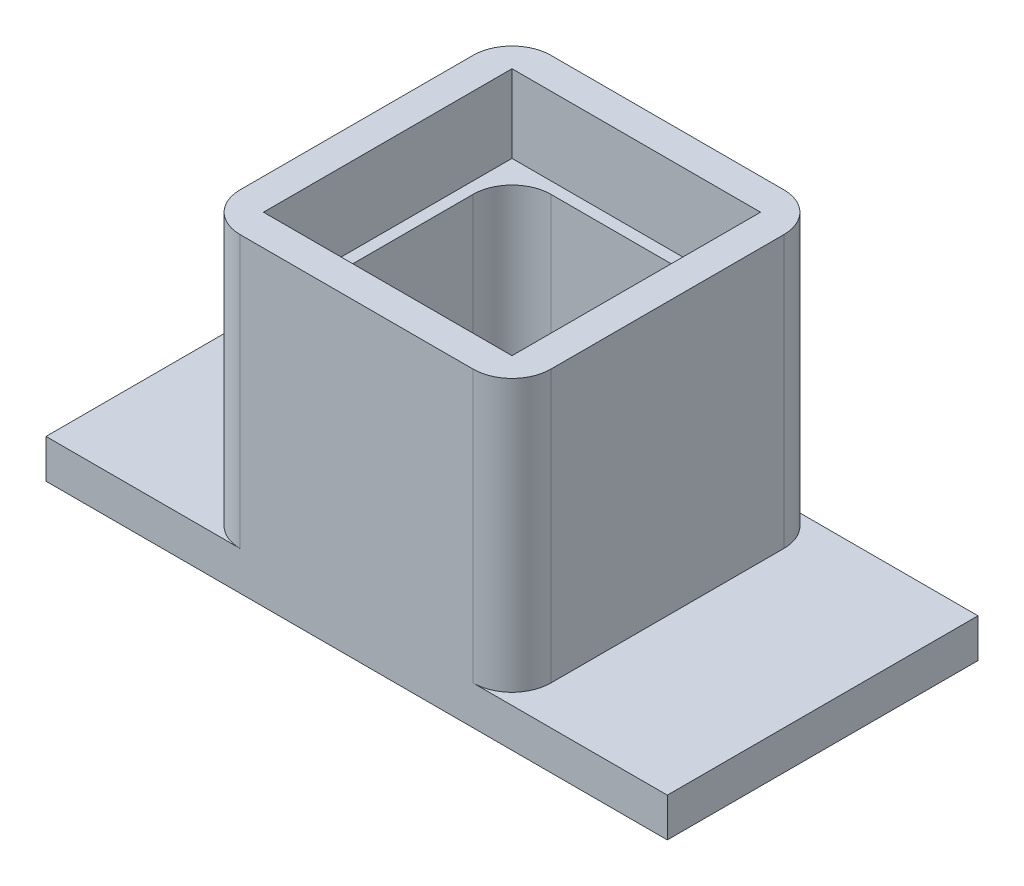
ISO-10303-21;
HEADER;
FILE_DESCRIPTION(('STEP AP214'),'2;1');
FILE_NAME('part.step','',(''),(''),'','','');
FILE_SCHEMA(('AUTOMOTIVE_DESIGN { 1 0 10303 214 1 1 1 1 }'));
ENDSEC;
DATA;
#1=APPLICATION_CONTEXT('core data for automotive mechanical design processes');
#2=APPLICATION_PROTOCOL_DEFINITION('international standard','automotive_design',2000,#1);
#3=PRODUCT_CONTEXT('',#1,'mechanical');
#4=PRODUCT('Part','Part','',(#3));
#5=PRODUCT_RELATED_PRODUCT_CATEGORY('part','',(#4));
#6=PRODUCT_DEFINITION_FORMATION('','',#4);
#7=PRODUCT_DEFINITION_CONTEXT('part definition',#1,'design');
#8=PRODUCT_DEFINITION('design','',#6,#7);
#9=PRODUCT_DEFINITION_SHAPE('','',#8);
#10=(LENGTH_UNIT() NAMED_UNIT(*) SI_UNIT(.MILLI.,.METRE.));
#11=(NAMED_UNIT(*) PLANE_ANGLE_UNIT() SI_UNIT($,.RADIAN.));
#12=(NAMED_UNIT(*) SI_UNIT($,.STERADIAN.) SOLID_ANGLE_UNIT());
#13=UNCERTAINTY_MEASURE_WITH_UNIT(LENGTH_MEASURE(1.E-05),#10,'distance_accuracy_value','');
#14=(GEOMETRIC_REPRESENTATION_CONTEXT(3) GLOBAL_UNCERTAINTY_ASSIGNED_CONTEXT((#13)) GLOBAL_UNIT_ASSIGNED_CONTEXT((#10,
#11,#12)) REPRESENTATION_CONTEXT('',''));
#15=CARTESIAN_POINT('',(0.,0.,0.));
#16=DIRECTION('',(0.,0.,1.));
#17=DIRECTION('',(1.,0.,0.));
#18=AXIS2_PLACEMENT_3D('',#15,#16,#17);
#19=CARTESIAN_POINT('',(0.,25.,0.));
#20=DIRECTION('',(0.,-1.,0.));
#21=DIRECTION('',(0.,0.,-1.));
#22=AXIS2_PLACEMENT_3D('',#19,#20,#21);
#23=PLANE('',#22);
#24=DIRECTION('',(0.,0.,-1.));
#25=VECTOR('',#24,1.);
#26=CARTESIAN_POINT('',(36.,25.,-36.));
#27=LINE('',#26,#25);
#28=CARTESIAN_POINT('',(36.,25.,-4.));
#29=VERTEX_POINT('',#28);
#30=CARTESIAN_POINT('',(36.,25.,-36.));
#31=VERTEX_POINT('',#30);
#32=EDGE_CURVE('E233',#29,#31,#27,.T.);
#33=ORIENTED_EDGE('',*,*,#32,.T.);
#34=DIRECTION('',(-1.,0.,0.));
#35=VECTOR('',#34,1.);
#36=CARTESIAN_POINT('',(4.,25.,-36.));
#37=LINE('',#36,#35);
#38=CARTESIAN_POINT('',(4.,25.,-36.));
#39=VERTEX_POINT('',#38);
#40=EDGE_CURVE('E221',#31,#39,#37,.T.);
#41=ORIENTED_EDGE('',*,*,#40,.T.);
#42=DIRECTION('',(0.,0.,1.));
#43=VECTOR('',#42,1.);
#44=CARTESIAN_POINT('',(4.,25.,-36.));
#45=LINE('',#44,#43);
#46=CARTESIAN_POINT('',(4.,25.,-4.));
#47=VERTEX_POINT('',#46);
#48=EDGE_CURVE('E224',#39,#47,#45,.T.);
#49=ORIENTED_EDGE('',*,*,#48,.T.);
#50=DIRECTION('',(1.,0.,0.));
#51=VECTOR('',#50,1.);
#52=CARTESIAN_POINT('',(4.,25.,-4.));
#53=LINE('',#52,#51);
#54=EDGE_CURVE('E243',#47,#29,#53,.T.);
#55=ORIENTED_EDGE('',*,*,#54,.T.);
#56=EDGE_LOOP('',(#33,#41,#49,#55));
#57=FACE_BOUND('',#56,.T.);
#58=DIRECTION('',(1.,0.,0.));
#59=VECTOR('',#58,1.);
#60=CARTESIAN_POINT('',(5.5,25.,-5.5));
#61=LINE('',#60,#59);
#62=CARTESIAN_POINT('',(10.5,25.,-5.5));
#63=VERTEX_POINT('',#62);
#64=CARTESIAN_POINT('',(29.5,25.,-5.5));
#65=VERTEX_POINT('',#64);
#66=EDGE_CURVE('E268',#63,#65,#61,.T.);
#67=ORIENTED_EDGE('',*,*,#66,.F.);
#68=CARTESIAN_POINT('',(10.5,25.,-10.5));
#69=DIRECTION('',(0.,-1.,0.));
#70=DIRECTION('',(0.,0.,-1.));
#71=AXIS2_PLACEMENT_3D('',#68,#69,#70);
#72=CIRCLE('',#71,5.);
#73=CARTESIAN_POINT('',(5.5,25.,-10.5));
#74=VERTEX_POINT('',#73);
#75=EDGE_CURVE('E338',#63,#74,#72,.T.);
#76=ORIENTED_EDGE('',*,*,#75,.T.);
#77=DIRECTION('',(0.,0.,1.));
#78=VECTOR('',#77,1.);
#79=CARTESIAN_POINT('',(5.5,25.,-5.5));
#80=LINE('',#79,#78);
#81=CARTESIAN_POINT('',(5.5,25.,-29.5));
#82=VERTEX_POINT('',#81);
#83=EDGE_CURVE('E277',#82,#74,#80,.T.);
#84=ORIENTED_EDGE('',*,*,#83,.F.);
#85=CARTESIAN_POINT('',(10.5,25.,-29.5));
#86=DIRECTION('',(0.,-1.,0.));
#87=DIRECTION('',(0.,0.,-1.));
#88=AXIS2_PLACEMENT_3D('',#85,#86,#87);
#89=CIRCLE('',#88,5.);
#90=CARTESIAN_POINT('',(10.5,25.,-34.5));
#91=VERTEX_POINT('',#90);
#92=EDGE_CURVE('E334',#82,#91,#89,.T.);
#93=ORIENTED_EDGE('',*,*,#92,.T.);
#94=DIRECTION('',(-1.,0.,0.));
#95=VECTOR('',#94,1.);
#96=CARTESIAN_POINT('',(5.5,25.,-34.5));
#97=LINE('',#96,#95);
#98=CARTESIAN_POINT('',(29.5,25.,-34.5));
#99=VERTEX_POINT('',#98);
#100=EDGE_CURVE('E274',#99,#91,#97,.T.);
#101=ORIENTED_EDGE('',*,*,#100,.F.);
#102=CARTESIAN_POINT('',(29.5,25.,-29.5));
#103=DIRECTION('',(0.,-1.,0.));
#104=DIRECTION('',(0.,0.,-1.));
#105=AXIS2_PLACEMENT_3D('',#102,#103,#104);
#106=CIRCLE('',#105,5.);
#107=CARTESIAN_POINT('',(34.5,25.,-29.5));
#108=VERTEX_POINT('',#107);
#109=EDGE_CURVE('E346',#99,#108,#106,.T.);
#110=ORIENTED_EDGE('',*,*,#109,.T.);
#111=DIRECTION('',(0.,0.,-1.));
#112=VECTOR('',#111,1.);
#113=CARTESIAN_POINT('',(34.5,25.,-5.5));
#114=LINE('',#113,#112);
#115=CARTESIAN_POINT('',(34.5,25.,-10.5));
#116=VERTEX_POINT('',#115);
#117=EDGE_CURVE('E271',#116,#108,#114,.T.);
#118=ORIENTED_EDGE('',*,*,#117,.F.);
#119=CARTESIAN_POINT('',(29.5,25.,-10.5));
#120=DIRECTION('',(0.,-1.,0.));
#121=DIRECTION('',(0.,0.,-1.));
#122=AXIS2_PLACEMENT_3D('',#119,#120,#121);
#123=CIRCLE('',#122,5.);
#124=EDGE_CURVE('E342',#116,#65,#123,.T.);
#125=ORIENTED_EDGE('',*,*,#124,.T.);
#126=EDGE_LOOP('',(#67,#76,#84,#93,#101,#110,#118,#125));
#127=FACE_BOUND('',#126,.T.);
#128=ADVANCED_FACE('F33',(#57,#127),#23,.F.);
#129=CARTESIAN_POINT('',(0.,25.,0.));
#130=DIRECTION('',(1.,0.,0.));
#131=DIRECTION('',(0.,0.,-1.));
#132=AXIS2_PLACEMENT_3D('',#129,#130,#131);
#133=PLANE('',#132);
#134=DIRECTION('',(0.,0.,1.));
#135=VECTOR('',#134,1.);
#136=CARTESIAN_POINT('',(0.,35.,-40.));
#137=LINE('',#136,#135);
#138=CARTESIAN_POINT('',(0.,35.,-35.));
#139=VERTEX_POINT('',#138);
#140=CARTESIAN_POINT('',(0.,35.,-5.));
#141=VERTEX_POINT('',#140);
#142=EDGE_CURVE('E256',#139,#141,#137,.T.);
#143=ORIENTED_EDGE('',*,*,#142,.F.);
#144=DIRECTION('',(0.,-1.,0.));
#145=VECTOR('',#144,1.);
#146=CARTESIAN_POINT('',(0.,25.,-35.));
#147=LINE('',#146,#145);
#148=CARTESIAN_POINT('',(0.,0.,-35.));
#149=VERTEX_POINT('',#148);
#150=EDGE_CURVE('E330',#139,#149,#147,.T.);
#151=ORIENTED_EDGE('',*,*,#150,.T.);
#152=DIRECTION('',(0.,0.,1.));
#153=VECTOR('',#152,1.);
#154=CARTESIAN_POINT('',(0.,0.,0.));
#155=LINE('',#154,#153);
#156=CARTESIAN_POINT('',(0.,0.,-5.));
#157=VERTEX_POINT('',#156);
#158=EDGE_CURVE('E280',#149,#157,#155,.T.);
#159=ORIENTED_EDGE('',*,*,#158,.T.);
#160=DIRECTION('',(0.,-1.,0.));
#161=VECTOR('',#160,1.);
#162=CARTESIAN_POINT('',(0.,25.,-5.));
#163=LINE('',#162,#161);
#164=EDGE_CURVE('E328',#157,#141,#163,.F.);
#165=ORIENTED_EDGE('',*,*,#164,.T.);
#166=EDGE_LOOP('',(#143,#151,#159,#165));
#167=FACE_BOUND('',#166,.T.);
#168=ADVANCED_FACE('F447',(#167),#133,.F.);
#169=CARTESIAN_POINT('',(0.,25.,0.));
#170=DIRECTION('',(0.,0.,-1.));
#171=DIRECTION('',(-1.,0.,0.));
#172=AXIS2_PLACEMENT_3D('',#169,#170,#171);
#173=PLANE('',#172);
#174=DIRECTION('',(-1.,0.,0.));
#175=VECTOR('',#174,1.);
#176=CARTESIAN_POINT('',(-20.,0.,0.));
#177=LINE('',#176,#175);
#178=CARTESIAN_POINT('',(60.,0.,0.));
#179=VERTEX_POINT('',#178);
#180=CARTESIAN_POINT('',(35.,0.,0.));
#181=VERTEX_POINT('',#180);
#182=EDGE_CURVE('E216',#179,#181,#177,.T.);
#183=ORIENTED_EDGE('',*,*,#182,.T.);
#184=DIRECTION('',(0.,-1.,0.));
#185=VECTOR('',#184,1.);
#186=CARTESIAN_POINT('',(35.,25.,0.));
#187=LINE('',#186,#185);
#188=CARTESIAN_POINT('',(35.,35.,0.));
#189=VERTEX_POINT('',#188);
#190=EDGE_CURVE('E313',#181,#189,#187,.F.);
#191=ORIENTED_EDGE('',*,*,#190,.T.);
#192=DIRECTION('',(1.,0.,0.));
#193=VECTOR('',#192,1.);
#194=CARTESIAN_POINT('',(0.,35.,0.));
#195=LINE('',#194,#193);
#196=CARTESIAN_POINT('',(5.,35.,0.));
#197=VERTEX_POINT('',#196);
#198=EDGE_CURVE('E259',#197,#189,#195,.T.);
#199=ORIENTED_EDGE('',*,*,#198,.F.);
#200=DIRECTION('',(0.,-1.,0.));
#201=VECTOR('',#200,1.);
#202=CARTESIAN_POINT('',(5.,25.,0.));
#203=LINE('',#202,#201);
#204=CARTESIAN_POINT('',(5.,0.,0.));
#205=VERTEX_POINT('',#204);
#206=EDGE_CURVE('E310',#197,#205,#203,.T.);
#207=ORIENTED_EDGE('',*,*,#206,.T.);
#208=CARTESIAN_POINT('',(-20.,0.,0.));
#209=VERTEX_POINT('',#208);
#210=EDGE_CURVE('E379',#205,#209,#177,.T.);
#211=ORIENTED_EDGE('',*,*,#210,.T.);
#212=DIRECTION('',(0.,1.,0.));
#213=VECTOR('',#212,1.);
#214=CARTESIAN_POINT('',(-20.,-5.,0.));
#215=LINE('',#214,#213);
#216=CARTESIAN_POINT('',(-20.,-5.,0.));
#217=VERTEX_POINT('',#216);
#218=EDGE_CURVE('E384',#217,#209,#215,.T.);
#219=ORIENTED_EDGE('',*,*,#218,.F.);
#220=DIRECTION('',(-1.,0.,0.));
#221=VECTOR('',#220,1.);
#222=CARTESIAN_POINT('',(-20.,-5.,0.));
#223=LINE('',#222,#221);
#224=CARTESIAN_POINT('',(60.,-5.,0.));
#225=VERTEX_POINT('',#224);
#226=EDGE_CURVE('E212',#225,#217,#223,.T.);
#227=ORIENTED_EDGE('',*,*,#226,.F.);
#228=DIRECTION('',(0.,1.,0.));
#229=VECTOR('',#228,1.);
#230=CARTESIAN_POINT('',(60.,-5.,0.));
#231=LINE('',#230,#229);
#232=EDGE_CURVE('E226',#225,#179,#231,.T.);
#233=ORIENTED_EDGE('',*,*,#232,.T.);
#234=EDGE_LOOP('',(#183,#191,#199,#207,#211,#219,#227,#233));
#235=FACE_BOUND('',#234,.T.);
#236=ADVANCED_FACE('F386',(#235),#173,.F.);
#237=CARTESIAN_POINT('',(40.,25.,0.));
#238=DIRECTION('',(-1.,0.,0.));
#239=DIRECTION('',(0.,0.,1.));
#240=AXIS2_PLACEMENT_3D('',#237,#238,#239);
#241=PLANE('',#240);
#242=DIRECTION('',(0.,0.,-1.));
#243=VECTOR('',#242,1.);
#244=CARTESIAN_POINT('',(40.,35.,-40.));
#245=LINE('',#244,#243);
#246=CARTESIAN_POINT('',(40.,35.,-5.));
#247=VERTEX_POINT('',#246);
#248=CARTESIAN_POINT('',(40.,35.,-35.));
#249=VERTEX_POINT('',#248);
#250=EDGE_CURVE('E262',#247,#249,#245,.T.);
#251=ORIENTED_EDGE('',*,*,#250,.F.);
#252=DIRECTION('',(0.,-1.,0.));
#253=VECTOR('',#252,1.);
#254=CARTESIAN_POINT('',(40.,25.,-5.));
#255=LINE('',#254,#253);
#256=CARTESIAN_POINT('',(40.,0.,-5.));
#257=VERTEX_POINT('',#256);
#258=EDGE_CURVE('E307',#247,#257,#255,.T.);
#259=ORIENTED_EDGE('',*,*,#258,.T.);
#260=DIRECTION('',(0.,0.,-1.));
#261=VECTOR('',#260,1.);
#262=CARTESIAN_POINT('',(40.,0.,0.));
#263=LINE('',#262,#261);
#264=CARTESIAN_POINT('',(40.,0.,-35.));
#265=VERTEX_POINT('',#264);
#266=EDGE_CURVE('E282',#257,#265,#263,.T.);
#267=ORIENTED_EDGE('',*,*,#266,.T.);
#268=DIRECTION('',(0.,-1.,0.));
#269=VECTOR('',#268,1.);
#270=CARTESIAN_POINT('',(40.,25.,-35.));
#271=LINE('',#270,#269);
#272=EDGE_CURVE('E305',#265,#249,#271,.F.);
#273=ORIENTED_EDGE('',*,*,#272,.T.);
#274=EDGE_LOOP('',(#251,#259,#267,#273));
#275=FACE_BOUND('',#274,.T.);
#276=ADVANCED_FACE('F460',(#275),#241,.F.);
#277=CARTESIAN_POINT('',(0.,25.,-40.));
#278=DIRECTION('',(0.,0.,1.));
#279=DIRECTION('',(1.,0.,0.));
#280=AXIS2_PLACEMENT_3D('',#277,#278,#279);
#281=PLANE('',#280);
#282=DIRECTION('',(-1.,0.,0.));
#283=VECTOR('',#282,1.);
#284=CARTESIAN_POINT('',(0.,35.,-40.));
#285=LINE('',#284,#283);
#286=CARTESIAN_POINT('',(35.,35.,-40.));
#287=VERTEX_POINT('',#286);
#288=CARTESIAN_POINT('',(5.,35.,-40.));
#289=VERTEX_POINT('',#288);
#290=EDGE_CURVE('E265',#287,#289,#285,.T.);
#291=ORIENTED_EDGE('',*,*,#290,.F.);
#292=DIRECTION('',(0.,-1.,0.));
#293=VECTOR('',#292,1.);
#294=CARTESIAN_POINT('',(35.,25.,-40.));
#295=LINE('',#294,#293);
#296=CARTESIAN_POINT('',(35.,0.,-40.));
#297=VERTEX_POINT('',#296);
#298=EDGE_CURVE('E325',#287,#297,#295,.T.);
#299=ORIENTED_EDGE('',*,*,#298,.T.);
#300=DIRECTION('',(1.,0.,0.));
#301=VECTOR('',#300,1.);
#302=CARTESIAN_POINT('',(-20.,0.,-40.));
#303=LINE('',#302,#301);
#304=CARTESIAN_POINT('',(60.,0.,-40.));
#305=VERTEX_POINT('',#304);
#306=EDGE_CURVE('E367',#297,#305,#303,.T.);
#307=ORIENTED_EDGE('',*,*,#306,.T.);
#308=DIRECTION('',(0.,1.,0.));
#309=VECTOR('',#308,1.);
#310=CARTESIAN_POINT('',(60.,-5.,-40.));
#311=LINE('',#310,#309);
#312=CARTESIAN_POINT('',(60.,-5.,-40.));
#313=VERTEX_POINT('',#312);
#314=EDGE_CURVE('E202',#313,#305,#311,.T.);
#315=ORIENTED_EDGE('',*,*,#314,.F.);
#316=DIRECTION('',(1.,0.,0.));
#317=VECTOR('',#316,1.);
#318=CARTESIAN_POINT('',(-20.,-5.,-40.));
#319=LINE('',#318,#317);
#320=CARTESIAN_POINT('',(-20.,-5.,-40.));
#321=VERTEX_POINT('',#320);
#322=EDGE_CURVE('E194',#321,#313,#319,.T.);
#323=ORIENTED_EDGE('',*,*,#322,.F.);
#324=DIRECTION('',(0.,1.,0.));
#325=VECTOR('',#324,1.);
#326=CARTESIAN_POINT('',(-20.,-5.,-40.));
#327=LINE('',#326,#325);
#328=CARTESIAN_POINT('',(-20.,0.,-40.));
#329=VERTEX_POINT('',#328);
#330=EDGE_CURVE('E199',#321,#329,#327,.T.);
#331=ORIENTED_EDGE('',*,*,#330,.T.);
#332=CARTESIAN_POINT('',(5.,0.,-40.));
#333=VERTEX_POINT('',#332);
#334=EDGE_CURVE('E353',#329,#333,#303,.T.);
#335=ORIENTED_EDGE('',*,*,#334,.T.);
#336=DIRECTION('',(0.,-1.,0.));
#337=VECTOR('',#336,1.);
#338=CARTESIAN_POINT('',(5.,25.,-40.));
#339=LINE('',#338,#337);
#340=EDGE_CURVE('E323',#333,#289,#339,.F.);
#341=ORIENTED_EDGE('',*,*,#340,.T.);
#342=EDGE_LOOP('',(#291,#299,#307,#315,#323,#331,#335,#341));
#343=FACE_BOUND('',#342,.T.);
#344=ADVANCED_FACE('F197',(#343),#281,.F.);
#345=CARTESIAN_POINT('',(5.5,25.,-5.5));
#346=DIRECTION('',(0.,0.,-1.));
#347=DIRECTION('',(-1.,0.,0.));
#348=AXIS2_PLACEMENT_3D('',#345,#346,#347);
#349=PLANE('',#348);
#350=DIRECTION('',(-1.,0.,0.));
#351=VECTOR('',#350,1.);
#352=CARTESIAN_POINT('',(5.5,-5.,-5.5));
#353=LINE('',#352,#351);
#354=CARTESIAN_POINT('',(29.5,-5.,-5.5));
#355=VERTEX_POINT('',#354);
#356=CARTESIAN_POINT('',(10.5,-5.,-5.5));
#357=VERTEX_POINT('',#356);
#358=EDGE_CURVE('E389',#355,#357,#353,.T.);
#359=ORIENTED_EDGE('',*,*,#358,.T.);
#360=DIRECTION('',(0.,-1.,0.));
#361=VECTOR('',#360,1.);
#362=CARTESIAN_POINT('',(10.5,25.,-5.5));
#363=LINE('',#362,#361);
#364=EDGE_CURVE('E298',#357,#63,#363,.F.);
#365=ORIENTED_EDGE('',*,*,#364,.T.);
#366=ORIENTED_EDGE('',*,*,#66,.T.);
#367=DIRECTION('',(0.,-1.,0.));
#368=VECTOR('',#367,1.);
#369=CARTESIAN_POINT('',(29.5,-5.,-5.5));
#370=LINE('',#369,#368);
#371=EDGE_CURVE('E295',#65,#355,#370,.T.);
#372=ORIENTED_EDGE('',*,*,#371,.T.);
#373=EDGE_LOOP('',(#359,#365,#366,#372));
#374=FACE_BOUND('',#373,.T.);
#375=ADVANCED_FACE('F435',(#374),#349,.T.);
#376=CARTESIAN_POINT('',(34.5,25.,-5.5));
#377=DIRECTION('',(-1.,0.,0.));
#378=DIRECTION('',(0.,0.,1.));
#379=AXIS2_PLACEMENT_3D('',#376,#377,#378);
#380=PLANE('',#379);
#381=DIRECTION('',(0.,0.,1.));
#382=VECTOR('',#381,1.);
#383=CARTESIAN_POINT('',(34.5,-5.,-5.5));
#384=LINE('',#383,#382);
#385=CARTESIAN_POINT('',(34.5,-5.,-29.5));
#386=VERTEX_POINT('',#385);
#387=CARTESIAN_POINT('',(34.5,-5.,-10.5));
#388=VERTEX_POINT('',#387);
#389=EDGE_CURVE('E391',#386,#388,#384,.T.);
#390=ORIENTED_EDGE('',*,*,#389,.T.);
#391=DIRECTION('',(0.,-1.,0.));
#392=VECTOR('',#391,1.);
#393=CARTESIAN_POINT('',(34.5,25.,-10.5));
#394=LINE('',#393,#392);
#395=EDGE_CURVE('E303',#388,#116,#394,.F.);
#396=ORIENTED_EDGE('',*,*,#395,.T.);
#397=ORIENTED_EDGE('',*,*,#117,.T.);
#398=DIRECTION('',(0.,-1.,0.));
#399=VECTOR('',#398,1.);
#400=CARTESIAN_POINT('',(34.5,-5.,-29.5));
#401=LINE('',#400,#399);
#402=EDGE_CURVE('E300',#108,#386,#401,.T.);
#403=ORIENTED_EDGE('',*,*,#402,.T.);
#404=EDGE_LOOP('',(#390,#396,#397,#403));
#405=FACE_BOUND('',#404,.T.);
#406=ADVANCED_FACE('F428',(#405),#380,.T.);
#407=CARTESIAN_POINT('',(5.5,25.,-34.5));
#408=DIRECTION('',(0.,0.,1.));
#409=DIRECTION('',(1.,0.,0.));
#410=AXIS2_PLACEMENT_3D('',#407,#408,#409);
#411=PLANE('',#410);
#412=ORIENTED_EDGE('',*,*,#100,.T.);
#413=DIRECTION('',(0.,-1.,0.));
#414=VECTOR('',#413,1.);
#415=CARTESIAN_POINT('',(10.5,-5.,-34.5));
#416=LINE('',#415,#414);
#417=CARTESIAN_POINT('',(10.5,-5.,-34.5));
#418=VERTEX_POINT('',#417);
#419=EDGE_CURVE('E287',#91,#418,#416,.T.);
#420=ORIENTED_EDGE('',*,*,#419,.T.);
#421=DIRECTION('',(1.,0.,0.));
#422=VECTOR('',#421,1.);
#423=CARTESIAN_POINT('',(5.5,-5.,-34.5));
#424=LINE('',#423,#422);
#425=CARTESIAN_POINT('',(29.5,-5.,-34.5));
#426=VERTEX_POINT('',#425);
#427=EDGE_CURVE('E397',#418,#426,#424,.T.);
#428=ORIENTED_EDGE('',*,*,#427,.T.);
#429=DIRECTION('',(0.,-1.,0.));
#430=VECTOR('',#429,1.);
#431=CARTESIAN_POINT('',(29.5,25.,-34.5));
#432=LINE('',#431,#430);
#433=EDGE_CURVE('E285',#426,#99,#432,.F.);
#434=ORIENTED_EDGE('',*,*,#433,.T.);
#435=EDGE_LOOP('',(#412,#420,#428,#434));
#436=FACE_BOUND('',#435,.T.);
#437=ADVANCED_FACE('F419',(#436),#411,.T.);
#438=CARTESIAN_POINT('',(5.5,25.,-5.5));
#439=DIRECTION('',(1.,0.,0.));
#440=DIRECTION('',(0.,0.,-1.));
#441=AXIS2_PLACEMENT_3D('',#438,#439,#440);
#442=PLANE('',#441);
#443=DIRECTION('',(0.,0.,-1.));
#444=VECTOR('',#443,1.);
#445=CARTESIAN_POINT('',(5.5,-5.,-5.5));
#446=LINE('',#445,#444);
#447=CARTESIAN_POINT('',(5.5,-5.,-10.5));
#448=VERTEX_POINT('',#447);
#449=CARTESIAN_POINT('',(5.5,-5.,-29.5));
#450=VERTEX_POINT('',#449);
#451=EDGE_CURVE('E402',#448,#450,#446,.T.);
#452=ORIENTED_EDGE('',*,*,#451,.T.);
#453=DIRECTION('',(0.,-1.,0.));
#454=VECTOR('',#453,1.);
#455=CARTESIAN_POINT('',(5.5,25.,-29.5));
#456=LINE('',#455,#454);
#457=EDGE_CURVE('E293',#450,#82,#456,.F.);
#458=ORIENTED_EDGE('',*,*,#457,.T.);
#459=ORIENTED_EDGE('',*,*,#83,.T.);
#460=DIRECTION('',(0.,-1.,0.));
#461=VECTOR('',#460,1.);
#462=CARTESIAN_POINT('',(5.5,-5.,-10.5));
#463=LINE('',#462,#461);
#464=EDGE_CURVE('E290',#74,#448,#463,.T.);
#465=ORIENTED_EDGE('',*,*,#464,.T.);
#466=EDGE_LOOP('',(#452,#458,#459,#465));
#467=FACE_BOUND('',#466,.T.);
#468=ADVANCED_FACE('F407',(#467),#442,.T.);
#469=CARTESIAN_POINT('',(0.,35.,0.));
#470=DIRECTION('',(0.,1.,0.));
#471=DIRECTION('',(0.,0.,1.));
#472=AXIS2_PLACEMENT_3D('',#469,#470,#471);
#473=PLANE('',#472);
#474=ORIENTED_EDGE('',*,*,#198,.T.);
#475=CARTESIAN_POINT('',(35.,35.,-5.));
#476=DIRECTION('',(0.,1.,0.));
#477=DIRECTION('',(0.,0.,1.));
#478=AXIS2_PLACEMENT_3D('',#475,#476,#477);
#479=CIRCLE('',#478,5.);
#480=EDGE_CURVE('E321',#189,#247,#479,.T.);
#481=ORIENTED_EDGE('',*,*,#480,.T.);
#482=ORIENTED_EDGE('',*,*,#250,.T.);
#483=CARTESIAN_POINT('',(35.,35.,-35.));
#484=DIRECTION('',(0.,1.,0.));
#485=DIRECTION('',(0.,0.,1.));
#486=AXIS2_PLACEMENT_3D('',#483,#484,#485);
#487=CIRCLE('',#486,5.);
#488=EDGE_CURVE('E319',#249,#287,#487,.T.);
#489=ORIENTED_EDGE('',*,*,#488,.T.);
#490=ORIENTED_EDGE('',*,*,#290,.T.);
#491=CARTESIAN_POINT('',(5.,35.,-35.));
#492=DIRECTION('',(0.,1.,0.));
#493=DIRECTION('',(0.,0.,1.));
#494=AXIS2_PLACEMENT_3D('',#491,#492,#493);
#495=CIRCLE('',#494,5.);
#496=EDGE_CURVE('E317',#289,#139,#495,.T.);
#497=ORIENTED_EDGE('',*,*,#496,.T.);
#498=ORIENTED_EDGE('',*,*,#142,.T.);
#499=CARTESIAN_POINT('',(5.,35.,-5.));
#500=DIRECTION('',(0.,1.,0.));
#501=DIRECTION('',(0.,0.,1.));
#502=AXIS2_PLACEMENT_3D('',#499,#500,#501);
#503=CIRCLE('',#502,5.);
#504=EDGE_CURVE('E315',#141,#197,#503,.T.);
#505=ORIENTED_EDGE('',*,*,#504,.T.);
#506=EDGE_LOOP('',(#474,#481,#482,#489,#490,#497,#498,#505));
#507=FACE_BOUND('',#506,.T.);
#508=DIRECTION('',(0.,0.,1.));
#509=VECTOR('',#508,1.);
#510=CARTESIAN_POINT('',(4.,35.,-36.));
#511=LINE('',#510,#509);
#512=CARTESIAN_POINT('',(4.,35.,-36.));
#513=VERTEX_POINT('',#512);
#514=CARTESIAN_POINT('',(4.,35.,-4.));
#515=VERTEX_POINT('',#514);
#516=EDGE_CURVE('E232',#513,#515,#511,.T.);
#517=ORIENTED_EDGE('',*,*,#516,.F.);
#518=DIRECTION('',(-1.,0.,0.));
#519=VECTOR('',#518,1.);
#520=CARTESIAN_POINT('',(4.,35.,-36.));
#521=LINE('',#520,#519);
#522=CARTESIAN_POINT('',(36.,35.,-36.));
#523=VERTEX_POINT('',#522);
#524=EDGE_CURVE('E230',#523,#513,#521,.T.);
#525=ORIENTED_EDGE('',*,*,#524,.F.);
#526=DIRECTION('',(0.,0.,-1.));
#527=VECTOR('',#526,1.);
#528=CARTESIAN_POINT('',(36.,35.,-36.));
#529=LINE('',#528,#527);
#530=CARTESIAN_POINT('',(36.,35.,-4.));
#531=VERTEX_POINT('',#530);
#532=EDGE_CURVE('E238',#531,#523,#529,.T.);
#533=ORIENTED_EDGE('',*,*,#532,.F.);
#534=DIRECTION('',(1.,0.,0.));
#535=VECTOR('',#534,1.);
#536=CARTESIAN_POINT('',(4.,35.,-4.));
#537=LINE('',#536,#535);
#538=EDGE_CURVE('E235',#515,#531,#537,.T.);
#539=ORIENTED_EDGE('',*,*,#538,.F.);
#540=EDGE_LOOP('',(#517,#525,#533,#539));
#541=FACE_BOUND('',#540,.T.);
#542=ADVANCED_FACE('F358',(#507,#541),#473,.T.);
#543=CARTESIAN_POINT('',(4.,35.,-36.));
#544=DIRECTION('',(0.,0.,1.));
#545=DIRECTION('',(1.,0.,0.));
#546=AXIS2_PLACEMENT_3D('',#543,#544,#545);
#547=PLANE('',#546);
#548=ORIENTED_EDGE('',*,*,#40,.F.);
#549=DIRECTION('',(0.,-1.,0.));
#550=VECTOR('',#549,1.);
#551=CARTESIAN_POINT('',(36.,35.,-36.));
#552=LINE('',#551,#550);
#553=EDGE_CURVE('E239',#523,#31,#552,.T.);
#554=ORIENTED_EDGE('',*,*,#553,.F.);
#555=ORIENTED_EDGE('',*,*,#524,.T.);
#556=DIRECTION('',(0.,-1.,0.));
#557=VECTOR('',#556,1.);
#558=CARTESIAN_POINT('',(4.,35.,-36.));
#559=LINE('',#558,#557);
#560=EDGE_CURVE('E253',#513,#39,#559,.T.);
#561=ORIENTED_EDGE('',*,*,#560,.T.);
#562=EDGE_LOOP('',(#548,#554,#555,#561));
#563=FACE_BOUND('',#562,.T.);
#564=ADVANCED_FACE('F564',(#563),#547,.T.);
#565=CARTESIAN_POINT('',(4.,35.,-36.));
#566=DIRECTION('',(1.,0.,0.));
#567=DIRECTION('',(0.,0.,-1.));
#568=AXIS2_PLACEMENT_3D('',#565,#566,#567);
#569=PLANE('',#568);
#570=ORIENTED_EDGE('',*,*,#48,.F.);
#571=ORIENTED_EDGE('',*,*,#560,.F.);
#572=ORIENTED_EDGE('',*,*,#516,.T.);
#573=DIRECTION('',(0.,-1.,0.));
#574=VECTOR('',#573,1.);
#575=CARTESIAN_POINT('',(4.,35.,-4.));
#576=LINE('',#575,#574);
#577=EDGE_CURVE('E251',#515,#47,#576,.T.);
#578=ORIENTED_EDGE('',*,*,#577,.T.);
#579=EDGE_LOOP('',(#570,#571,#572,#578));
#580=FACE_BOUND('',#579,.T.);
#581=ADVANCED_FACE('F661',(#580),#569,.T.);
#582=CARTESIAN_POINT('',(4.,35.,-4.));
#583=DIRECTION('',(0.,0.,-1.));
#584=DIRECTION('',(-1.,0.,0.));
#585=AXIS2_PLACEMENT_3D('',#582,#583,#584);
#586=PLANE('',#585);
#587=ORIENTED_EDGE('',*,*,#54,.F.);
#588=ORIENTED_EDGE('',*,*,#577,.F.);
#589=ORIENTED_EDGE('',*,*,#538,.T.);
#590=DIRECTION('',(0.,-1.,0.));
#591=VECTOR('',#590,1.);
#592=CARTESIAN_POINT('',(36.,35.,-4.));
#593=LINE('',#592,#591);
#594=EDGE_CURVE('E249',#531,#29,#593,.T.);
#595=ORIENTED_EDGE('',*,*,#594,.T.);
#596=EDGE_LOOP('',(#587,#588,#589,#595));
#597=FACE_BOUND('',#596,.T.);
#598=ADVANCED_FACE('F651',(#597),#586,.T.);
#599=CARTESIAN_POINT('',(36.,35.,-36.));
#600=DIRECTION('',(-1.,0.,0.));
#601=DIRECTION('',(0.,0.,1.));
#602=AXIS2_PLACEMENT_3D('',#599,#600,#601);
#603=PLANE('',#602);
#604=ORIENTED_EDGE('',*,*,#32,.F.);
#605=ORIENTED_EDGE('',*,*,#594,.F.);
#606=ORIENTED_EDGE('',*,*,#532,.T.);
#607=ORIENTED_EDGE('',*,*,#553,.T.);
#608=EDGE_LOOP('',(#604,#605,#606,#607));
#609=FACE_BOUND('',#608,.T.);
#610=ADVANCED_FACE('F445',(#609),#603,.T.);
#611=CARTESIAN_POINT('',(0.,0.,0.));
#612=DIRECTION('',(0.,-1.,0.));
#613=DIRECTION('',(0.,0.,-1.));
#614=AXIS2_PLACEMENT_3D('',#611,#612,#613);
#615=PLANE('',#614);
#616=ORIENTED_EDGE('',*,*,#158,.F.);
#617=CARTESIAN_POINT('',(5.,0.,-35.));
#618=DIRECTION('',(0.,-1.,0.));
#619=DIRECTION('',(0.,0.,-1.));
#620=AXIS2_PLACEMENT_3D('',#617,#618,#619);
#621=CIRCLE('',#620,5.);
#622=EDGE_CURVE('E41',#149,#333,#621,.T.);
#623=ORIENTED_EDGE('',*,*,#622,.T.);
#624=ORIENTED_EDGE('',*,*,#334,.F.);
#625=DIRECTION('',(0.,0.,-1.));
#626=VECTOR('',#625,1.);
#627=CARTESIAN_POINT('',(-20.,0.,0.));
#628=LINE('',#627,#626);
#629=EDGE_CURVE('E220',#209,#329,#628,.T.);
#630=ORIENTED_EDGE('',*,*,#629,.F.);
#631=ORIENTED_EDGE('',*,*,#210,.F.);
#632=CARTESIAN_POINT('',(5.,0.,-5.));
#633=DIRECTION('',(0.,-1.,0.));
#634=DIRECTION('',(0.,0.,-1.));
#635=AXIS2_PLACEMENT_3D('',#632,#633,#634);
#636=CIRCLE('',#635,5.);
#637=EDGE_CURVE('E11',#205,#157,#636,.T.);
#638=ORIENTED_EDGE('',*,*,#637,.T.);
#639=EDGE_LOOP('',(#616,#623,#624,#630,#631,#638));
#640=FACE_BOUND('',#639,.T.);
#641=ADVANCED_FACE('F352',(#640),#615,.F.);
#642=CARTESIAN_POINT('',(0.,-5.,0.));
#643=DIRECTION('',(0.,-1.,0.));
#644=DIRECTION('',(0.,0.,-1.));
#645=AXIS2_PLACEMENT_3D('',#642,#643,#644);
#646=PLANE('',#645);
#647=DIRECTION('',(0.,0.,-1.));
#648=VECTOR('',#647,1.);
#649=CARTESIAN_POINT('',(-20.,-5.,0.));
#650=LINE('',#649,#648);
#651=EDGE_CURVE('E206',#217,#321,#650,.T.);
#652=ORIENTED_EDGE('',*,*,#651,.T.);
#653=ORIENTED_EDGE('',*,*,#322,.T.);
#654=DIRECTION('',(0.,0.,1.));
#655=VECTOR('',#654,1.);
#656=CARTESIAN_POINT('',(60.,-5.,0.));
#657=LINE('',#656,#655);
#658=EDGE_CURVE('E205',#313,#225,#657,.T.);
#659=ORIENTED_EDGE('',*,*,#658,.T.);
#660=ORIENTED_EDGE('',*,*,#226,.T.);
#661=EDGE_LOOP('',(#652,#653,#659,#660));
#662=FACE_BOUND('',#661,.T.);
#663=ORIENTED_EDGE('',*,*,#427,.F.);
#664=CARTESIAN_POINT('',(10.5,-5.,-29.5));
#665=DIRECTION('',(0.,-1.,0.));
#666=DIRECTION('',(0.,0.,-1.));
#667=AXIS2_PLACEMENT_3D('',#664,#665,#666);
#668=CIRCLE('',#667,5.);
#669=EDGE_CURVE('E332',#418,#450,#668,.F.);
#670=ORIENTED_EDGE('',*,*,#669,.T.);
#671=ORIENTED_EDGE('',*,*,#451,.F.);
#672=CARTESIAN_POINT('',(10.5,-5.,-10.5));
#673=DIRECTION('',(0.,-1.,0.));
#674=DIRECTION('',(0.,0.,-1.));
#675=AXIS2_PLACEMENT_3D('',#672,#673,#674);
#676=CIRCLE('',#675,5.);
#677=EDGE_CURVE('E336',#448,#357,#676,.F.);
#678=ORIENTED_EDGE('',*,*,#677,.T.);
#679=ORIENTED_EDGE('',*,*,#358,.F.);
#680=CARTESIAN_POINT('',(29.5,-5.,-10.5));
#681=DIRECTION('',(0.,-1.,0.));
#682=DIRECTION('',(0.,0.,-1.));
#683=AXIS2_PLACEMENT_3D('',#680,#681,#682);
#684=CIRCLE('',#683,5.);
#685=EDGE_CURVE('E340',#355,#388,#684,.F.);
#686=ORIENTED_EDGE('',*,*,#685,.T.);
#687=ORIENTED_EDGE('',*,*,#389,.F.);
#688=CARTESIAN_POINT('',(29.5,-5.,-29.5));
#689=DIRECTION('',(0.,-1.,0.));
#690=DIRECTION('',(0.,0.,-1.));
#691=AXIS2_PLACEMENT_3D('',#688,#689,#690);
#692=CIRCLE('',#691,5.);
#693=EDGE_CURVE('E344',#386,#426,#692,.F.);
#694=ORIENTED_EDGE('',*,*,#693,.T.);
#695=EDGE_LOOP('',(#663,#670,#671,#678,#679,#686,#687,#694));
#696=FACE_BOUND('',#695,.T.);
#697=ADVANCED_FACE('F209',(#662,#696),#646,.T.);
#698=ORIENTED_EDGE('',*,*,#266,.F.);
#699=CARTESIAN_POINT('',(35.,0.,-5.));
#700=DIRECTION('',(0.,-1.,0.));
#701=DIRECTION('',(0.,0.,-1.));
#702=AXIS2_PLACEMENT_3D('',#699,#700,#701);
#703=CIRCLE('',#702,5.);
#704=EDGE_CURVE('E348',#257,#181,#703,.T.);
#705=ORIENTED_EDGE('',*,*,#704,.T.);
#706=ORIENTED_EDGE('',*,*,#182,.F.);
#707=DIRECTION('',(0.,0.,1.));
#708=VECTOR('',#707,1.);
#709=CARTESIAN_POINT('',(60.,0.,0.));
#710=LINE('',#709,#708);
#711=EDGE_CURVE('E374',#305,#179,#710,.T.);
#712=ORIENTED_EDGE('',*,*,#711,.F.);
#713=ORIENTED_EDGE('',*,*,#306,.F.);
#714=CARTESIAN_POINT('',(35.,0.,-35.));
#715=DIRECTION('',(0.,-1.,0.));
#716=DIRECTION('',(0.,0.,-1.));
#717=AXIS2_PLACEMENT_3D('',#714,#715,#716);
#718=CIRCLE('',#717,5.);
#719=EDGE_CURVE('E351',#297,#265,#718,.T.);
#720=ORIENTED_EDGE('',*,*,#719,.T.);
#721=EDGE_LOOP('',(#698,#705,#706,#712,#713,#720));
#722=FACE_BOUND('',#721,.T.);
#723=ADVANCED_FACE('F378',(#722),#615,.F.);
#724=CARTESIAN_POINT('',(-20.,-5.,0.));
#725=DIRECTION('',(1.,0.,0.));
#726=DIRECTION('',(0.,0.,-1.));
#727=AXIS2_PLACEMENT_3D('',#724,#725,#726);
#728=PLANE('',#727);
#729=ORIENTED_EDGE('',*,*,#629,.T.);
#730=ORIENTED_EDGE('',*,*,#330,.F.);
#731=ORIENTED_EDGE('',*,*,#651,.F.);
#732=ORIENTED_EDGE('',*,*,#218,.T.);
#733=EDGE_LOOP('',(#729,#730,#731,#732));
#734=FACE_BOUND('',#733,.T.);
#735=ADVANCED_FACE('F218',(#734),#728,.F.);
#736=CARTESIAN_POINT('',(60.,-5.,0.));
#737=DIRECTION('',(-1.,0.,0.));
#738=DIRECTION('',(0.,0.,1.));
#739=AXIS2_PLACEMENT_3D('',#736,#737,#738);
#740=PLANE('',#739);
#741=ORIENTED_EDGE('',*,*,#711,.T.);
#742=ORIENTED_EDGE('',*,*,#232,.F.);
#743=ORIENTED_EDGE('',*,*,#658,.F.);
#744=ORIENTED_EDGE('',*,*,#314,.T.);
#745=EDGE_LOOP('',(#741,#742,#743,#744));
#746=FACE_BOUND('',#745,.T.);
#747=ADVANCED_FACE('F372',(#746),#740,.F.);
#748=CARTESIAN_POINT('',(10.5,25.,-29.5));
#749=DIRECTION('',(0.,1.,0.));
#750=DIRECTION('',(0.,0.,1.));
#751=AXIS2_PLACEMENT_3D('',#748,#749,#750);
#752=CYLINDRICAL_SURFACE('',#751,5.);
#753=ORIENTED_EDGE('',*,*,#92,.F.);
#754=ORIENTED_EDGE('',*,*,#457,.F.);
#755=ORIENTED_EDGE('',*,*,#669,.F.);
#756=ORIENTED_EDGE('',*,*,#419,.F.);
#757=EDGE_LOOP('',(#753,#754,#755,#756));
#758=FACE_BOUND('',#757,.T.);
#759=ADVANCED_FACE('F412',(#758),#752,.F.);
#760=CARTESIAN_POINT('',(10.5,25.,-10.5));
#761=DIRECTION('',(0.,1.,0.));
#762=DIRECTION('',(0.,0.,1.));
#763=AXIS2_PLACEMENT_3D('',#760,#761,#762);
#764=CYLINDRICAL_SURFACE('',#763,5.);
#765=ORIENTED_EDGE('',*,*,#75,.F.);
#766=ORIENTED_EDGE('',*,*,#364,.F.);
#767=ORIENTED_EDGE('',*,*,#677,.F.);
#768=ORIENTED_EDGE('',*,*,#464,.F.);
#769=EDGE_LOOP('',(#765,#766,#767,#768));
#770=FACE_BOUND('',#769,.T.);
#771=ADVANCED_FACE('F437',(#770),#764,.F.);
#772=CARTESIAN_POINT('',(29.5,25.,-10.5));
#773=DIRECTION('',(0.,1.,0.));
#774=DIRECTION('',(0.,0.,1.));
#775=AXIS2_PLACEMENT_3D('',#772,#773,#774);
#776=CYLINDRICAL_SURFACE('',#775,5.);
#777=ORIENTED_EDGE('',*,*,#124,.F.);
#778=ORIENTED_EDGE('',*,*,#395,.F.);
#779=ORIENTED_EDGE('',*,*,#685,.F.);
#780=ORIENTED_EDGE('',*,*,#371,.F.);
#781=EDGE_LOOP('',(#777,#778,#779,#780));
#782=FACE_BOUND('',#781,.T.);
#783=ADVANCED_FACE('F432',(#782),#776,.F.);
#784=CARTESIAN_POINT('',(29.5,25.,-29.5));
#785=DIRECTION('',(0.,1.,0.));
#786=DIRECTION('',(0.,0.,1.));
#787=AXIS2_PLACEMENT_3D('',#784,#785,#786);
#788=CYLINDRICAL_SURFACE('',#787,5.);
#789=ORIENTED_EDGE('',*,*,#109,.F.);
#790=ORIENTED_EDGE('',*,*,#433,.F.);
#791=ORIENTED_EDGE('',*,*,#693,.F.);
#792=ORIENTED_EDGE('',*,*,#402,.F.);
#793=EDGE_LOOP('',(#789,#790,#791,#792));
#794=FACE_BOUND('',#793,.T.);
#795=ADVANCED_FACE('F423',(#794),#788,.F.);
#796=CARTESIAN_POINT('',(35.,25.,-5.));
#797=DIRECTION('',(0.,-1.,0.));
#798=DIRECTION('',(0.,0.,-1.));
#799=AXIS2_PLACEMENT_3D('',#796,#797,#798);
#800=CYLINDRICAL_SURFACE('',#799,5.);
#801=ORIENTED_EDGE('',*,*,#480,.F.);
#802=ORIENTED_EDGE('',*,*,#190,.F.);
#803=ORIENTED_EDGE('',*,*,#704,.F.);
#804=ORIENTED_EDGE('',*,*,#258,.F.);
#805=EDGE_LOOP('',(#801,#802,#803,#804));
#806=FACE_BOUND('',#805,.T.);
#807=ADVANCED_FACE('F474',(#806),#800,.T.);
#808=CARTESIAN_POINT('',(35.,25.,-35.));
#809=DIRECTION('',(0.,-1.,0.));
#810=DIRECTION('',(0.,0.,-1.));
#811=AXIS2_PLACEMENT_3D('',#808,#809,#810);
#812=CYLINDRICAL_SURFACE('',#811,5.);
#813=ORIENTED_EDGE('',*,*,#488,.F.);
#814=ORIENTED_EDGE('',*,*,#272,.F.);
#815=ORIENTED_EDGE('',*,*,#719,.F.);
#816=ORIENTED_EDGE('',*,*,#298,.F.);
#817=EDGE_LOOP('',(#813,#814,#815,#816));
#818=FACE_BOUND('',#817,.T.);
#819=ADVANCED_FACE('F365',(#818),#812,.T.);
#820=CARTESIAN_POINT('',(5.,25.,-35.));
#821=DIRECTION('',(0.,-1.,0.));
#822=DIRECTION('',(0.,0.,-1.));
#823=AXIS2_PLACEMENT_3D('',#820,#821,#822);
#824=CYLINDRICAL_SURFACE('',#823,5.);
#825=ORIENTED_EDGE('',*,*,#496,.F.);
#826=ORIENTED_EDGE('',*,*,#340,.F.);
#827=ORIENTED_EDGE('',*,*,#622,.F.);
#828=ORIENTED_EDGE('',*,*,#150,.F.);
#829=EDGE_LOOP('',(#825,#826,#827,#828));
#830=FACE_BOUND('',#829,.T.);
#831=ADVANCED_FACE('F355',(#830),#824,.T.);
#832=CARTESIAN_POINT('',(5.,25.,-5.));
#833=DIRECTION('',(0.,-1.,0.));
#834=DIRECTION('',(0.,0.,-1.));
#835=AXIS2_PLACEMENT_3D('',#832,#833,#834);
#836=CYLINDRICAL_SURFACE('',#835,5.);
#837=ORIENTED_EDGE('',*,*,#504,.F.);
#838=ORIENTED_EDGE('',*,*,#164,.F.);
#839=ORIENTED_EDGE('',*,*,#637,.F.);
#840=ORIENTED_EDGE('',*,*,#206,.F.);
#841=EDGE_LOOP('',(#837,#838,#839,#840));
#842=FACE_BOUND('',#841,.T.);
#843=ADVANCED_FACE('F35',(#842),#836,.T.);
#844=CLOSED_SHELL('',(#128,#168,#236,#276,#344,#375,#406,#437,#468,#542,#564,#581,#598,#610,
#641,#697,#723,#735,#747,#759,#771,#783,#795,#807,#819,#831,#843));
#845=MANIFOLD_SOLID_BREP('B2',#844);
#846=ADVANCED_BREP_SHAPE_REPRESENTATION('',(#18,#845),#14);
#847=SHAPE_DEFINITION_REPRESENTATION(#9,#846);
ENDSEC;
END-ISO-10303-21;
